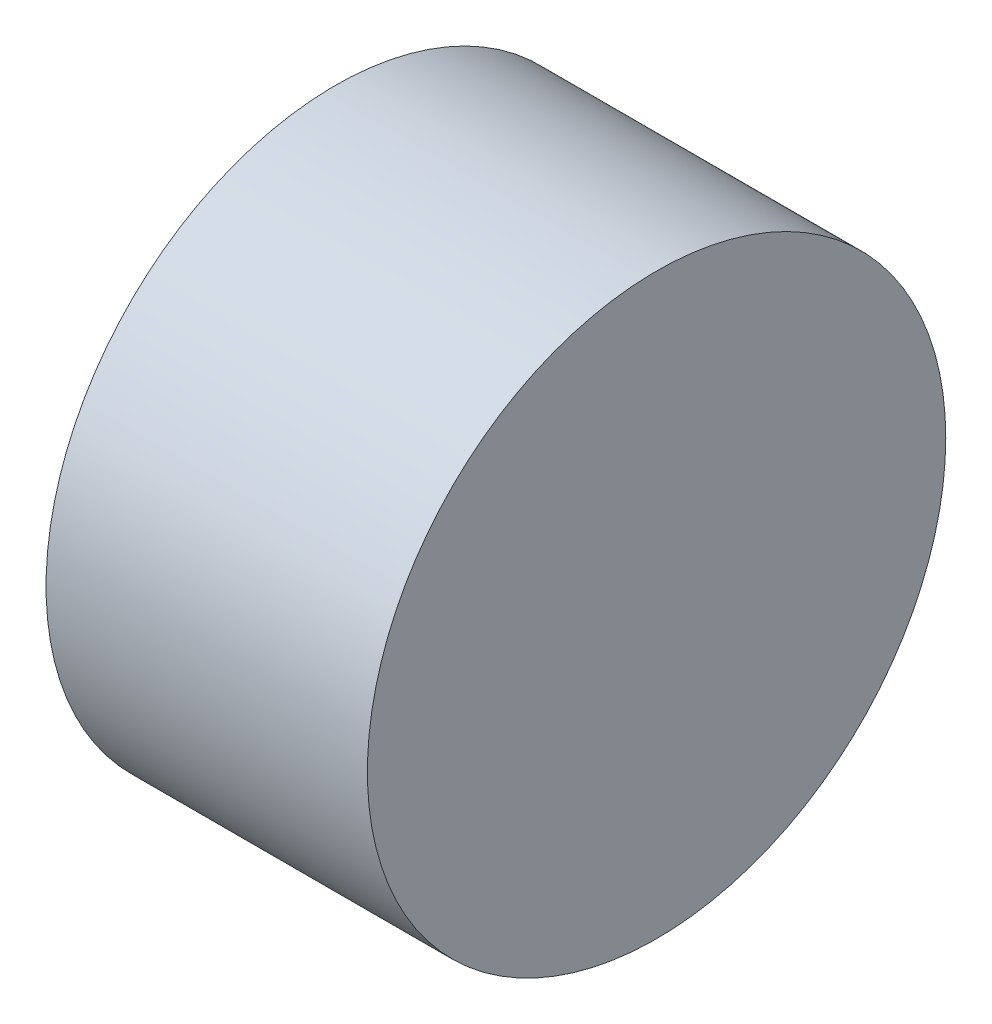
ISO-10303-21;
HEADER;
FILE_DESCRIPTION(('STEP AP214'),'2;1');
FILE_NAME('part.step','',(''),(''),'','','');
FILE_SCHEMA(('AUTOMOTIVE_DESIGN { 1 0 10303 214 1 1 1 1 }'));
ENDSEC;
DATA;
#1=APPLICATION_CONTEXT('core data for automotive mechanical design processes');
#2=APPLICATION_PROTOCOL_DEFINITION('international standard','automotive_design',2000,#1);
#3=PRODUCT_CONTEXT('',#1,'mechanical');
#4=PRODUCT('Part','Part','',(#3));
#5=PRODUCT_RELATED_PRODUCT_CATEGORY('part','',(#4));
#6=PRODUCT_DEFINITION_FORMATION('','',#4);
#7=PRODUCT_DEFINITION_CONTEXT('part definition',#1,'design');
#8=PRODUCT_DEFINITION('design','',#6,#7);
#9=PRODUCT_DEFINITION_SHAPE('','',#8);
#10=(LENGTH_UNIT() NAMED_UNIT(*) SI_UNIT(.MILLI.,.METRE.));
#11=(NAMED_UNIT(*) PLANE_ANGLE_UNIT() SI_UNIT($,.RADIAN.));
#12=(NAMED_UNIT(*) SI_UNIT($,.STERADIAN.) SOLID_ANGLE_UNIT());
#13=UNCERTAINTY_MEASURE_WITH_UNIT(LENGTH_MEASURE(1.E-05),#10,'distance_accuracy_value','');
#14=(GEOMETRIC_REPRESENTATION_CONTEXT(3) GLOBAL_UNCERTAINTY_ASSIGNED_CONTEXT((#13)) GLOBAL_UNIT_ASSIGNED_CONTEXT((#10,
#11,#12)) REPRESENTATION_CONTEXT('',''));
#15=CARTESIAN_POINT('',(0.,0.,0.));
#16=DIRECTION('',(0.,0.,1.));
#17=DIRECTION('',(1.,0.,0.));
#18=AXIS2_PLACEMENT_3D('',#15,#16,#17);
#19=CARTESIAN_POINT('',(0.1,-3.8,2.4));
#20=DIRECTION('',(1.,0.,0.));
#21=DIRECTION('',(0.,0.,-1.));
#22=AXIS2_PLACEMENT_3D('',#19,#20,#21);
#23=PLANE('',#22);
#24=CARTESIAN_POINT('',(0.1,-3.8,2.4));
#25=DIRECTION('',(1.,0.,0.));
#26=DIRECTION('',(0.,0.,-1.));
#27=AXIS2_PLACEMENT_3D('',#24,#25,#26);
#28=CIRCLE('',#27,0.18);
#29=CARTESIAN_POINT('',(0.1,-3.8,2.22));
#30=VERTEX_POINT('',#29);
#31=EDGE_CURVE('E18',#30,#30,#28,.F.);
#32=ORIENTED_EDGE('',*,*,#31,.F.);
#33=EDGE_LOOP('',(#32));
#34=FACE_BOUND('',#33,.T.);
#35=ADVANCED_FACE('F15',(#34),#23,.T.);
#36=CARTESIAN_POINT('',(-0.1,-3.8,2.4));
#37=DIRECTION('',(1.,0.,0.));
#38=DIRECTION('',(0.,0.,-1.));
#39=AXIS2_PLACEMENT_3D('',#36,#37,#38);
#40=PLANE('',#39);
#41=CARTESIAN_POINT('',(-0.1,-3.8,2.4));
#42=DIRECTION('',(1.,0.,0.));
#43=DIRECTION('',(0.,0.,-1.));
#44=AXIS2_PLACEMENT_3D('',#41,#42,#43);
#45=CIRCLE('',#44,0.18);
#46=CARTESIAN_POINT('',(-0.1,-3.8,2.22));
#47=VERTEX_POINT('',#46);
#48=EDGE_CURVE('E10',#47,#47,#45,.T.);
#49=ORIENTED_EDGE('',*,*,#48,.F.);
#50=EDGE_LOOP('',(#49));
#51=FACE_BOUND('',#50,.T.);
#52=ADVANCED_FACE('F33',(#51),#40,.F.);
#53=CARTESIAN_POINT('',(-0.1,-3.8,2.4));
#54=DIRECTION('',(1.,0.,0.));
#55=DIRECTION('',(0.,0.,-1.));
#56=AXIS2_PLACEMENT_3D('',#53,#54,#55);
#57=CYLINDRICAL_SURFACE('',#56,0.18);
#58=ORIENTED_EDGE('',*,*,#48,.T.);
#59=EDGE_LOOP('',(#58));
#60=FACE_BOUND('',#59,.T.);
#61=ORIENTED_EDGE('',*,*,#31,.T.);
#62=EDGE_LOOP('',(#61));
#63=FACE_BOUND('',#62,.T.);
#64=ADVANCED_FACE('F30',(#60,#63),#57,.T.);
#65=CLOSED_SHELL('',(#35,#52,#64));
#66=MANIFOLD_SOLID_BREP('B1',#65);
#67=ADVANCED_BREP_SHAPE_REPRESENTATION('',(#18,#66),#14);
#68=SHAPE_DEFINITION_REPRESENTATION(#9,#67);
ENDSEC;
END-ISO-10303-21;
